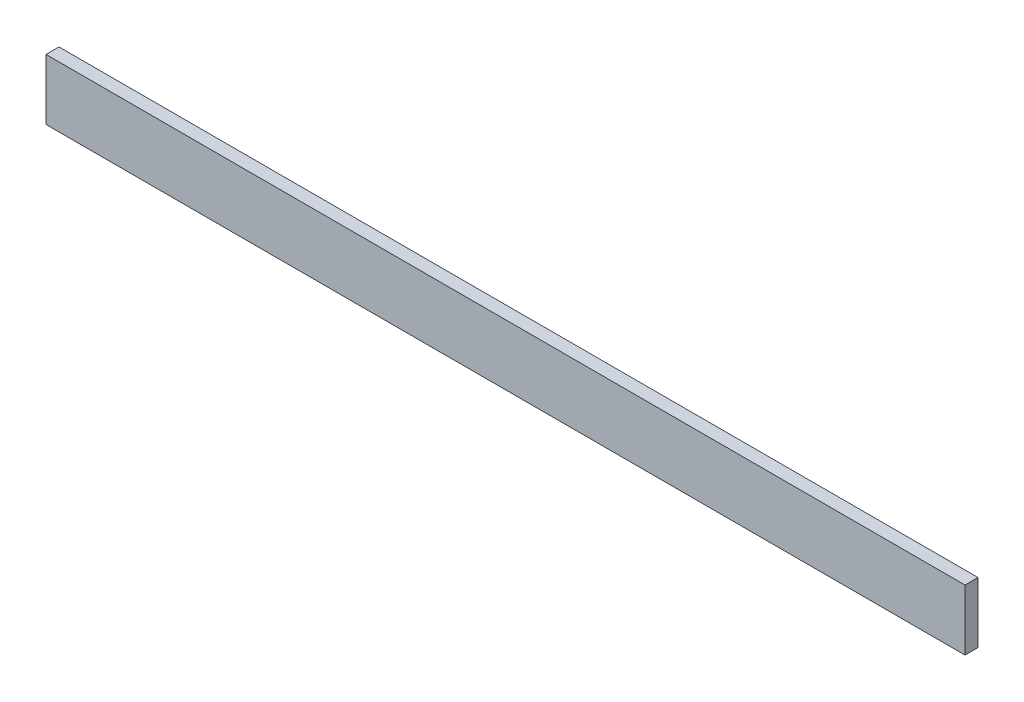
ISO-10303-21;
HEADER;
FILE_DESCRIPTION(('STEP AP214'),'2;1');
FILE_NAME('part.step','',(''),(''),'','','');
FILE_SCHEMA(('AUTOMOTIVE_DESIGN { 1 0 10303 214 1 1 1 1 }'));
ENDSEC;
DATA;
#1=APPLICATION_CONTEXT('core data for automotive mechanical design processes');
#2=APPLICATION_PROTOCOL_DEFINITION('international standard','automotive_design',2000,#1);
#3=PRODUCT_CONTEXT('',#1,'mechanical');
#4=PRODUCT('Part','Part','',(#3));
#5=PRODUCT_RELATED_PRODUCT_CATEGORY('part','',(#4));
#6=PRODUCT_DEFINITION_FORMATION('','',#4);
#7=PRODUCT_DEFINITION_CONTEXT('part definition',#1,'design');
#8=PRODUCT_DEFINITION('design','',#6,#7);
#9=PRODUCT_DEFINITION_SHAPE('','',#8);
#10=(LENGTH_UNIT() NAMED_UNIT(*) SI_UNIT(.MILLI.,.METRE.));
#11=(NAMED_UNIT(*) PLANE_ANGLE_UNIT() SI_UNIT($,.RADIAN.));
#12=(NAMED_UNIT(*) SI_UNIT($,.STERADIAN.) SOLID_ANGLE_UNIT());
#13=UNCERTAINTY_MEASURE_WITH_UNIT(LENGTH_MEASURE(1.E-05),#10,'distance_accuracy_value','');
#14=(GEOMETRIC_REPRESENTATION_CONTEXT(3) GLOBAL_UNCERTAINTY_ASSIGNED_CONTEXT((#13)) GLOBAL_UNIT_ASSIGNED_CONTEXT((#10,
#11,#12)) REPRESENTATION_CONTEXT('',''));
#15=CARTESIAN_POINT('',(0.,0.,0.));
#16=DIRECTION('',(0.,0.,1.));
#17=DIRECTION('',(1.,0.,0.));
#18=AXIS2_PLACEMENT_3D('',#15,#16,#17);
#19=CARTESIAN_POINT('',(53.,3.50000000000001,1.5));
#20=DIRECTION('',(-1.,0.,0.));
#21=DIRECTION('',(0.,0.,1.));
#22=AXIS2_PLACEMENT_3D('',#19,#20,#21);
#23=PLANE('',#22);
#24=DIRECTION('',(0.,1.,0.));
#25=VECTOR('',#24,1.);
#26=CARTESIAN_POINT('',(53.,3.50000000000001,0.));
#27=LINE('',#26,#25);
#28=CARTESIAN_POINT('',(53.,-3.49999999999999,0.));
#29=VERTEX_POINT('',#28);
#30=CARTESIAN_POINT('',(53.,3.50000000000001,0.));
#31=VERTEX_POINT('',#30);
#32=EDGE_CURVE('E95',#29,#31,#27,.T.);
#33=ORIENTED_EDGE('',*,*,#32,.T.);
#34=DIRECTION('',(0.,0.,-1.));
#35=VECTOR('',#34,1.);
#36=CARTESIAN_POINT('',(53.,3.50000000000001,1.5));
#37=LINE('',#36,#35);
#38=CARTESIAN_POINT('',(53.,3.50000000000001,1.5));
#39=VERTEX_POINT('',#38);
#40=EDGE_CURVE('E11',#39,#31,#37,.T.);
#41=ORIENTED_EDGE('',*,*,#40,.F.);
#42=DIRECTION('',(0.,1.,0.));
#43=VECTOR('',#42,1.);
#44=CARTESIAN_POINT('',(53.,3.50000000000001,1.5));
#45=LINE('',#44,#43);
#46=CARTESIAN_POINT('',(53.,-3.49999999999999,1.5));
#47=VERTEX_POINT('',#46);
#48=EDGE_CURVE('E83',#47,#39,#45,.T.);
#49=ORIENTED_EDGE('',*,*,#48,.F.);
#50=DIRECTION('',(0.,0.,-1.));
#51=VECTOR('',#50,1.);
#52=CARTESIAN_POINT('',(53.,-3.49999999999999,1.5));
#53=LINE('',#52,#51);
#54=EDGE_CURVE('E91',#47,#29,#53,.T.);
#55=ORIENTED_EDGE('',*,*,#54,.T.);
#56=EDGE_LOOP('',(#33,#41,#49,#55));
#57=FACE_BOUND('',#56,.T.);
#58=ADVANCED_FACE('F32',(#57),#23,.F.);
#59=CARTESIAN_POINT('',(53.,3.50000000000001,1.5));
#60=DIRECTION('',(0.,-1.,0.));
#61=DIRECTION('',(1.,0.,0.));
#62=AXIS2_PLACEMENT_3D('',#59,#60,#61);
#63=PLANE('',#62);
#64=DIRECTION('',(-1.,0.,0.));
#65=VECTOR('',#64,1.);
#66=CARTESIAN_POINT('',(53.,3.50000000000001,0.));
#67=LINE('',#66,#65);
#68=CARTESIAN_POINT('',(-53.,3.5,0.));
#69=VERTEX_POINT('',#68);
#70=EDGE_CURVE('E87',#31,#69,#67,.T.);
#71=ORIENTED_EDGE('',*,*,#70,.T.);
#72=DIRECTION('',(0.,0.,-1.));
#73=VECTOR('',#72,1.);
#74=CARTESIAN_POINT('',(-53.,3.5,1.5));
#75=LINE('',#74,#73);
#76=CARTESIAN_POINT('',(-53.,3.5,1.5));
#77=VERTEX_POINT('',#76);
#78=EDGE_CURVE('E40',#77,#69,#75,.T.);
#79=ORIENTED_EDGE('',*,*,#78,.F.);
#80=DIRECTION('',(-1.,0.,0.));
#81=VECTOR('',#80,1.);
#82=CARTESIAN_POINT('',(53.,3.50000000000001,1.5));
#83=LINE('',#82,#81);
#84=EDGE_CURVE('E78',#39,#77,#83,.T.);
#85=ORIENTED_EDGE('',*,*,#84,.F.);
#86=ORIENTED_EDGE('',*,*,#40,.T.);
#87=EDGE_LOOP('',(#71,#79,#85,#86));
#88=FACE_BOUND('',#87,.T.);
#89=ADVANCED_FACE('F86',(#88),#63,.F.);
#90=CARTESIAN_POINT('',(-53.,3.5,1.5));
#91=DIRECTION('',(1.,0.,0.));
#92=DIRECTION('',(0.,0.,-1.));
#93=AXIS2_PLACEMENT_3D('',#90,#91,#92);
#94=PLANE('',#93);
#95=DIRECTION('',(0.,-1.,0.));
#96=VECTOR('',#95,1.);
#97=CARTESIAN_POINT('',(-53.,3.5,0.));
#98=LINE('',#97,#96);
#99=CARTESIAN_POINT('',(-53.,-3.5,0.));
#100=VERTEX_POINT('',#99);
#101=EDGE_CURVE('E65',#69,#100,#98,.T.);
#102=ORIENTED_EDGE('',*,*,#101,.T.);
#103=DIRECTION('',(0.,0.,-1.));
#104=VECTOR('',#103,1.);
#105=CARTESIAN_POINT('',(-53.,-3.5,1.5));
#106=LINE('',#105,#104);
#107=CARTESIAN_POINT('',(-53.,-3.5,1.5));
#108=VERTEX_POINT('',#107);
#109=EDGE_CURVE('E88',#108,#100,#106,.T.);
#110=ORIENTED_EDGE('',*,*,#109,.F.);
#111=DIRECTION('',(0.,-1.,0.));
#112=VECTOR('',#111,1.);
#113=CARTESIAN_POINT('',(-53.,3.5,1.5));
#114=LINE('',#113,#112);
#115=EDGE_CURVE('E81',#77,#108,#114,.T.);
#116=ORIENTED_EDGE('',*,*,#115,.F.);
#117=ORIENTED_EDGE('',*,*,#78,.T.);
#118=EDGE_LOOP('',(#102,#110,#116,#117));
#119=FACE_BOUND('',#118,.T.);
#120=ADVANCED_FACE('F89',(#119),#94,.F.);
#121=CARTESIAN_POINT('',(53.,-3.49999999999999,1.5));
#122=DIRECTION('',(0.,1.,0.));
#123=DIRECTION('',(-1.,0.,0.));
#124=AXIS2_PLACEMENT_3D('',#121,#122,#123);
#125=PLANE('',#124);
#126=DIRECTION('',(1.,0.,0.));
#127=VECTOR('',#126,1.);
#128=CARTESIAN_POINT('',(53.,-3.49999999999999,0.));
#129=LINE('',#128,#127);
#130=EDGE_CURVE('E71',#100,#29,#129,.T.);
#131=ORIENTED_EDGE('',*,*,#130,.T.);
#132=ORIENTED_EDGE('',*,*,#54,.F.);
#133=DIRECTION('',(1.,0.,0.));
#134=VECTOR('',#133,1.);
#135=CARTESIAN_POINT('',(53.,-3.49999999999999,1.5));
#136=LINE('',#135,#134);
#137=EDGE_CURVE('E48',#108,#47,#136,.T.);
#138=ORIENTED_EDGE('',*,*,#137,.F.);
#139=ORIENTED_EDGE('',*,*,#109,.T.);
#140=EDGE_LOOP('',(#131,#132,#138,#139));
#141=FACE_BOUND('',#140,.T.);
#142=ADVANCED_FACE('F102',(#141),#125,.F.);
#143=CARTESIAN_POINT('',(0.,0.,1.5));
#144=DIRECTION('',(0.,0.,-1.));
#145=DIRECTION('',(-1.,0.,0.));
#146=AXIS2_PLACEMENT_3D('',#143,#144,#145);
#147=PLANE('',#146);
#148=ORIENTED_EDGE('',*,*,#48,.T.);
#149=ORIENTED_EDGE('',*,*,#84,.T.);
#150=ORIENTED_EDGE('',*,*,#115,.T.);
#151=ORIENTED_EDGE('',*,*,#137,.T.);
#152=EDGE_LOOP('',(#148,#149,#150,#151));
#153=FACE_BOUND('',#152,.T.);
#154=ADVANCED_FACE('F79',(#153),#147,.F.);
#155=CARTESIAN_POINT('',(0.,0.,0.));
#156=DIRECTION('',(0.,0.,-1.));
#157=DIRECTION('',(-1.,0.,0.));
#158=AXIS2_PLACEMENT_3D('',#155,#156,#157);
#159=PLANE('',#158);
#160=ORIENTED_EDGE('',*,*,#32,.F.);
#161=ORIENTED_EDGE('',*,*,#130,.F.);
#162=ORIENTED_EDGE('',*,*,#101,.F.);
#163=ORIENTED_EDGE('',*,*,#70,.F.);
#164=EDGE_LOOP('',(#160,#161,#162,#163));
#165=FACE_BOUND('',#164,.T.);
#166=ADVANCED_FACE('F105',(#165),#159,.T.);
#167=CLOSED_SHELL('',(#58,#89,#120,#142,#154,#166));
#168=MANIFOLD_SOLID_BREP('B2',#167);
#169=ADVANCED_BREP_SHAPE_REPRESENTATION('',(#18,#168),#14);
#170=SHAPE_DEFINITION_REPRESENTATION(#9,#169);
ENDSEC;
END-ISO-10303-21;
